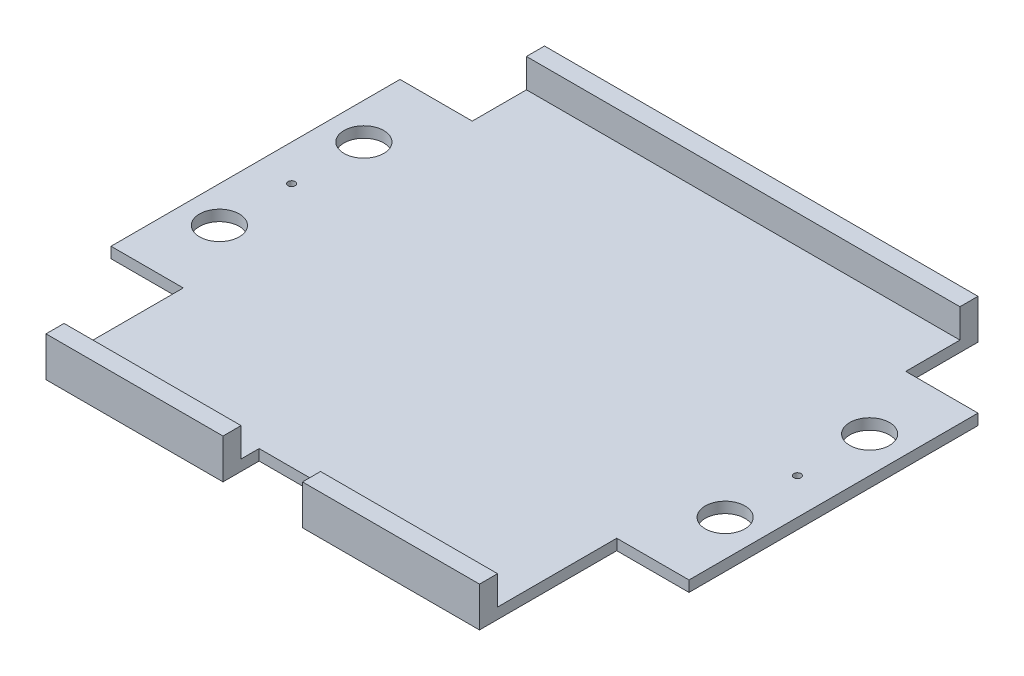
ISO-10303-21;
HEADER;
FILE_DESCRIPTION(('STEP AP214'),'2;1');
FILE_NAME('part.step','',(''),(''),'','','');
FILE_SCHEMA(('AUTOMOTIVE_DESIGN { 1 0 10303 214 1 1 1 1 }'));
ENDSEC;
DATA;
#1=APPLICATION_CONTEXT('core data for automotive mechanical design processes');
#2=APPLICATION_PROTOCOL_DEFINITION('international standard','automotive_design',2000,#1);
#3=PRODUCT_CONTEXT('',#1,'mechanical');
#4=PRODUCT('Part','Part','',(#3));
#5=PRODUCT_RELATED_PRODUCT_CATEGORY('part','',(#4));
#6=PRODUCT_DEFINITION_FORMATION('','',#4);
#7=PRODUCT_DEFINITION_CONTEXT('part definition',#1,'design');
#8=PRODUCT_DEFINITION('design','',#6,#7);
#9=PRODUCT_DEFINITION_SHAPE('','',#8);
#10=(LENGTH_UNIT() NAMED_UNIT(*) SI_UNIT(.MILLI.,.METRE.));
#11=(NAMED_UNIT(*) PLANE_ANGLE_UNIT() SI_UNIT($,.RADIAN.));
#12=(NAMED_UNIT(*) SI_UNIT($,.STERADIAN.) SOLID_ANGLE_UNIT());
#13=UNCERTAINTY_MEASURE_WITH_UNIT(LENGTH_MEASURE(1.E-05),#10,'distance_accuracy_value','');
#14=(GEOMETRIC_REPRESENTATION_CONTEXT(3) GLOBAL_UNCERTAINTY_ASSIGNED_CONTEXT((#13)) GLOBAL_UNIT_ASSIGNED_CONTEXT((#10,
#11,#12)) REPRESENTATION_CONTEXT('',''));
#15=CARTESIAN_POINT('',(0.,0.,0.));
#16=DIRECTION('',(0.,0.,1.));
#17=DIRECTION('',(1.,0.,0.));
#18=AXIS2_PLACEMENT_3D('',#15,#16,#17);
#19=CARTESIAN_POINT('',(-60.,3.,66.5));
#20=DIRECTION('',(1.,0.,0.));
#21=DIRECTION('',(0.,0.,-1.));
#22=AXIS2_PLACEMENT_3D('',#19,#20,#21);
#23=PLANE('',#22);
#24=DIRECTION('',(0.,0.,1.));
#25=VECTOR('',#24,1.);
#26=CARTESIAN_POINT('',(-60.,3.,66.5));
#27=LINE('',#26,#25);
#28=CARTESIAN_POINT('',(-60.,3.,28.5));
#29=VERTEX_POINT('',#28);
#30=CARTESIAN_POINT('',(-60.,3.,61.5));
#31=VERTEX_POINT('',#30);
#32=EDGE_CURVE('E57',#29,#31,#27,.T.);
#33=ORIENTED_EDGE('',*,*,#32,.F.);
#34=DIRECTION('',(0.,-1.,0.));
#35=VECTOR('',#34,1.);
#36=CARTESIAN_POINT('',(-60.,3.,28.5));
#37=LINE('',#36,#35);
#38=CARTESIAN_POINT('',(-60.,0.,28.5));
#39=VERTEX_POINT('',#38);
#40=EDGE_CURVE('E199',#29,#39,#37,.T.);
#41=ORIENTED_EDGE('',*,*,#40,.T.);
#42=DIRECTION('',(0.,0.,1.));
#43=VECTOR('',#42,1.);
#44=CARTESIAN_POINT('',(-60.,0.,66.5));
#45=LINE('',#44,#43);
#46=CARTESIAN_POINT('',(-60.,0.,66.5));
#47=VERTEX_POINT('',#46);
#48=EDGE_CURVE('E413',#39,#47,#45,.T.);
#49=ORIENTED_EDGE('',*,*,#48,.T.);
#50=DIRECTION('',(0.,-1.,0.));
#51=VECTOR('',#50,1.);
#52=CARTESIAN_POINT('',(-60.,3.,66.5));
#53=LINE('',#52,#51);
#54=CARTESIAN_POINT('',(-60.,11.,66.5));
#55=VERTEX_POINT('',#54);
#56=EDGE_CURVE('E425',#55,#47,#53,.T.);
#57=ORIENTED_EDGE('',*,*,#56,.F.);
#58=DIRECTION('',(0.,0.,1.));
#59=VECTOR('',#58,1.);
#60=CARTESIAN_POINT('',(-60.,11.,66.5));
#61=LINE('',#60,#59);
#62=CARTESIAN_POINT('',(-60.,11.,61.5));
#63=VERTEX_POINT('',#62);
#64=EDGE_CURVE('E367',#63,#55,#61,.T.);
#65=ORIENTED_EDGE('',*,*,#64,.F.);
#66=DIRECTION('',(0.,-1.,0.));
#67=VECTOR('',#66,1.);
#68=CARTESIAN_POINT('',(-60.,11.,61.5));
#69=LINE('',#68,#67);
#70=EDGE_CURVE('E385',#63,#31,#69,.T.);
#71=ORIENTED_EDGE('',*,*,#70,.T.);
#72=EDGE_LOOP('',(#33,#41,#49,#57,#65,#71));
#73=FACE_BOUND('',#72,.T.);
#74=ADVANCED_FACE('F39',(#73),#23,.F.);
#75=CARTESIAN_POINT('',(60.,3.,66.5));
#76=DIRECTION('',(-1.,0.,0.));
#77=DIRECTION('',(0.,0.,1.));
#78=AXIS2_PLACEMENT_3D('',#75,#76,#77);
#79=PLANE('',#78);
#80=DIRECTION('',(0.,-1.,0.));
#81=VECTOR('',#80,1.);
#82=CARTESIAN_POINT('',(60.,3.,28.5));
#83=LINE('',#82,#81);
#84=CARTESIAN_POINT('',(60.,3.,28.5));
#85=VERTEX_POINT('',#84);
#86=CARTESIAN_POINT('',(60.,0.,28.5));
#87=VERTEX_POINT('',#86);
#88=EDGE_CURVE('E284',#85,#87,#83,.T.);
#89=ORIENTED_EDGE('',*,*,#88,.F.);
#90=DIRECTION('',(0.,0.,-1.));
#91=VECTOR('',#90,1.);
#92=CARTESIAN_POINT('',(60.,3.,66.5));
#93=LINE('',#92,#91);
#94=CARTESIAN_POINT('',(60.,3.,61.5));
#95=VERTEX_POINT('',#94);
#96=EDGE_CURVE('E396',#95,#85,#93,.T.);
#97=ORIENTED_EDGE('',*,*,#96,.F.);
#98=DIRECTION('',(0.,-1.,0.));
#99=VECTOR('',#98,1.);
#100=CARTESIAN_POINT('',(60.,11.,61.5));
#101=LINE('',#100,#99);
#102=CARTESIAN_POINT('',(60.,11.,61.5));
#103=VERTEX_POINT('',#102);
#104=EDGE_CURVE('E391',#103,#95,#101,.T.);
#105=ORIENTED_EDGE('',*,*,#104,.F.);
#106=DIRECTION('',(0.,0.,-1.));
#107=VECTOR('',#106,1.);
#108=CARTESIAN_POINT('',(60.,11.,66.5));
#109=LINE('',#108,#107);
#110=CARTESIAN_POINT('',(60.,11.,66.5));
#111=VERTEX_POINT('',#110);
#112=EDGE_CURVE('E377',#111,#103,#109,.T.);
#113=ORIENTED_EDGE('',*,*,#112,.F.);
#114=DIRECTION('',(0.,-1.,0.));
#115=VECTOR('',#114,1.);
#116=CARTESIAN_POINT('',(60.,3.,66.5));
#117=LINE('',#116,#115);
#118=CARTESIAN_POINT('',(60.,0.,66.5));
#119=VERTEX_POINT('',#118);
#120=EDGE_CURVE('E408',#111,#119,#117,.T.);
#121=ORIENTED_EDGE('',*,*,#120,.T.);
#122=DIRECTION('',(0.,0.,-1.));
#123=VECTOR('',#122,1.);
#124=CARTESIAN_POINT('',(60.,0.,66.5));
#125=LINE('',#124,#123);
#126=EDGE_CURVE('E409',#119,#87,#125,.T.);
#127=ORIENTED_EDGE('',*,*,#126,.T.);
#128=EDGE_LOOP('',(#89,#97,#105,#113,#121,#127));
#129=FACE_BOUND('',#128,.T.);
#130=ADVANCED_FACE('F41',(#129),#79,.F.);
#131=DIRECTION('',(0.,1.,0.));
#132=VECTOR('',#131,1.);
#133=CARTESIAN_POINT('',(60.,3.,-51.5));
#134=LINE('',#133,#132);
#135=CARTESIAN_POINT('',(60.,0.,-51.5));
#136=VERTEX_POINT('',#135);
#137=CARTESIAN_POINT('',(60.,3.,-51.5));
#138=VERTEX_POINT('',#137);
#139=EDGE_CURVE('E280',#136,#138,#134,.T.);
#140=ORIENTED_EDGE('',*,*,#139,.F.);
#141=CARTESIAN_POINT('',(60.,0.,-71.5));
#142=VERTEX_POINT('',#141);
#143=EDGE_CURVE('E395',#136,#142,#125,.T.);
#144=ORIENTED_EDGE('',*,*,#143,.T.);
#145=DIRECTION('',(0.,-1.,0.));
#146=VECTOR('',#145,1.);
#147=CARTESIAN_POINT('',(60.,11.,-71.5));
#148=LINE('',#147,#146);
#149=CARTESIAN_POINT('',(60.,11.,-71.5));
#150=VERTEX_POINT('',#149);
#151=EDGE_CURVE('E308',#150,#142,#148,.T.);
#152=ORIENTED_EDGE('',*,*,#151,.F.);
#153=DIRECTION('',(0.,0.,-1.));
#154=VECTOR('',#153,1.);
#155=CARTESIAN_POINT('',(60.,11.,-66.5));
#156=LINE('',#155,#154);
#157=CARTESIAN_POINT('',(60.,11.,-66.5));
#158=VERTEX_POINT('',#157);
#159=EDGE_CURVE('E295',#158,#150,#156,.T.);
#160=ORIENTED_EDGE('',*,*,#159,.F.);
#161=DIRECTION('',(0.,-1.,0.));
#162=VECTOR('',#161,1.);
#163=CARTESIAN_POINT('',(60.,11.,-66.5));
#164=LINE('',#163,#162);
#165=CARTESIAN_POINT('',(60.,3.,-66.5));
#166=VERTEX_POINT('',#165);
#167=EDGE_CURVE('E312',#158,#166,#164,.T.);
#168=ORIENTED_EDGE('',*,*,#167,.T.);
#169=EDGE_CURVE('E401',#138,#166,#93,.T.);
#170=ORIENTED_EDGE('',*,*,#169,.F.);
#171=EDGE_LOOP('',(#140,#144,#152,#160,#168,#170));
#172=FACE_BOUND('',#171,.T.);
#173=ADVANCED_FACE('F497',(#172),#79,.F.);
#174=CARTESIAN_POINT('',(-60.,3.,66.5));
#175=DIRECTION('',(0.,0.,-1.));
#176=DIRECTION('',(-1.,0.,0.));
#177=AXIS2_PLACEMENT_3D('',#174,#175,#176);
#178=PLANE('',#177);
#179=DIRECTION('',(1.,0.,0.));
#180=VECTOR('',#179,1.);
#181=CARTESIAN_POINT('',(-60.,0.,66.5));
#182=LINE('',#181,#180);
#183=CARTESIAN_POINT('',(-11.,0.,66.5));
#184=VERTEX_POINT('',#183);
#185=EDGE_CURVE('E418',#47,#184,#182,.T.);
#186=ORIENTED_EDGE('',*,*,#185,.T.);
#187=DIRECTION('',(0.,1.,0.));
#188=VECTOR('',#187,1.);
#189=CARTESIAN_POINT('',(-11.,0.,66.5));
#190=LINE('',#189,#188);
#191=CARTESIAN_POINT('',(-11.,11.,66.5));
#192=VERTEX_POINT('',#191);
#193=EDGE_CURVE('E331',#184,#192,#190,.T.);
#194=ORIENTED_EDGE('',*,*,#193,.T.);
#195=DIRECTION('',(1.,0.,0.));
#196=VECTOR('',#195,1.);
#197=CARTESIAN_POINT('',(-60.,11.,66.5));
#198=LINE('',#197,#196);
#199=EDGE_CURVE('E373',#55,#192,#198,.T.);
#200=ORIENTED_EDGE('',*,*,#199,.F.);
#201=ORIENTED_EDGE('',*,*,#56,.T.);
#202=EDGE_LOOP('',(#186,#194,#200,#201));
#203=FACE_BOUND('',#202,.T.);
#204=ADVANCED_FACE('F507',(#203),#178,.F.);
#205=CARTESIAN_POINT('',(-60.,11.,61.5));
#206=DIRECTION('',(0.,0.,1.));
#207=DIRECTION('',(1.,0.,0.));
#208=AXIS2_PLACEMENT_3D('',#205,#206,#207);
#209=PLANE('',#208);
#210=DIRECTION('',(-1.,0.,0.));
#211=VECTOR('',#210,1.);
#212=CARTESIAN_POINT('',(-60.,11.,61.5));
#213=LINE('',#212,#211);
#214=CARTESIAN_POINT('',(-11.,11.,61.5));
#215=VERTEX_POINT('',#214);
#216=EDGE_CURVE('E380',#215,#63,#213,.T.);
#217=ORIENTED_EDGE('',*,*,#216,.F.);
#218=DIRECTION('',(0.,-1.,0.));
#219=VECTOR('',#218,1.);
#220=CARTESIAN_POINT('',(-11.,11.,61.5));
#221=LINE('',#220,#219);
#222=CARTESIAN_POINT('',(-11.,3.,61.5));
#223=VERTEX_POINT('',#222);
#224=EDGE_CURVE('E354',#215,#223,#221,.T.);
#225=ORIENTED_EDGE('',*,*,#224,.T.);
#226=DIRECTION('',(-1.,0.,0.));
#227=VECTOR('',#226,1.);
#228=CARTESIAN_POINT('',(-60.,3.,61.5));
#229=LINE('',#228,#227);
#230=EDGE_CURVE('E366',#223,#31,#229,.T.);
#231=ORIENTED_EDGE('',*,*,#230,.T.);
#232=ORIENTED_EDGE('',*,*,#70,.F.);
#233=EDGE_LOOP('',(#217,#225,#231,#232));
#234=FACE_BOUND('',#233,.T.);
#235=ADVANCED_FACE('F529',(#234),#209,.F.);
#236=CARTESIAN_POINT('',(0.,11.,0.));
#237=DIRECTION('',(0.,-1.,0.));
#238=DIRECTION('',(0.,0.,-1.));
#239=AXIS2_PLACEMENT_3D('',#236,#237,#238);
#240=PLANE('',#239);
#241=ORIENTED_EDGE('',*,*,#199,.T.);
#242=DIRECTION('',(0.,0.,-1.));
#243=VECTOR('',#242,1.);
#244=CARTESIAN_POINT('',(-11.,11.,0.));
#245=LINE('',#244,#243);
#246=EDGE_CURVE('E11',#192,#215,#245,.T.);
#247=ORIENTED_EDGE('',*,*,#246,.T.);
#248=ORIENTED_EDGE('',*,*,#216,.T.);
#249=ORIENTED_EDGE('',*,*,#64,.T.);
#250=EDGE_LOOP('',(#241,#247,#248,#249));
#251=FACE_BOUND('',#250,.T.);
#252=ADVANCED_FACE('F509',(#251),#240,.F.);
#253=CARTESIAN_POINT('',(0.,3.,0.));
#254=DIRECTION('',(0.,-1.,0.));
#255=DIRECTION('',(0.,0.,-1.));
#256=AXIS2_PLACEMENT_3D('',#253,#254,#255);
#257=PLANE('',#256);
#258=CARTESIAN_POINT('',(-70.,3.,-31.5));
#259=DIRECTION('',(0.,-1.,0.));
#260=DIRECTION('',(0.,0.,1.));
#261=AXIS2_PLACEMENT_3D('',#258,#259,#260);
#262=CIRCLE('',#261,5.5);
#263=CARTESIAN_POINT('',(-70.,3.,-26.));
#264=VERTEX_POINT('',#263);
#265=EDGE_CURVE('E464',#264,#264,#262,.T.);
#266=ORIENTED_EDGE('',*,*,#265,.T.);
#267=EDGE_LOOP('',(#266));
#268=FACE_BOUND('',#267,.T.);
#269=CARTESIAN_POINT('',(-70.,3.,8.5));
#270=DIRECTION('',(0.,-1.,0.));
#271=DIRECTION('',(0.,0.,1.));
#272=AXIS2_PLACEMENT_3D('',#269,#270,#271);
#273=CIRCLE('',#272,5.5);
#274=CARTESIAN_POINT('',(-70.,3.,14.));
#275=VERTEX_POINT('',#274);
#276=EDGE_CURVE('E467',#275,#275,#273,.T.);
#277=ORIENTED_EDGE('',*,*,#276,.T.);
#278=EDGE_LOOP('',(#277));
#279=FACE_BOUND('',#278,.T.);
#280=CARTESIAN_POINT('',(-70.,3.,-11.5));
#281=DIRECTION('',(0.,-1.,0.));
#282=DIRECTION('',(0.,0.,1.));
#283=AXIS2_PLACEMENT_3D('',#280,#281,#282);
#284=CIRCLE('',#283,0.999999999999998);
#285=CARTESIAN_POINT('',(-70.,3.,-10.5));
#286=VERTEX_POINT('',#285);
#287=EDGE_CURVE('E446',#286,#286,#284,.T.);
#288=ORIENTED_EDGE('',*,*,#287,.T.);
#289=EDGE_LOOP('',(#288));
#290=FACE_BOUND('',#289,.T.);
#291=DIRECTION('',(1.,0.,0.));
#292=VECTOR('',#291,1.);
#293=CARTESIAN_POINT('',(-80.,3.,28.5));
#294=LINE('',#293,#292);
#295=CARTESIAN_POINT('',(-80.,3.,28.5));
#296=VERTEX_POINT('',#295);
#297=EDGE_CURVE('E193',#296,#29,#294,.T.);
#298=ORIENTED_EDGE('',*,*,#297,.T.);
#299=ORIENTED_EDGE('',*,*,#32,.T.);
#300=ORIENTED_EDGE('',*,*,#230,.F.);
#301=DIRECTION('',(0.,0.,-1.));
#302=VECTOR('',#301,1.);
#303=CARTESIAN_POINT('',(-11.,3.,0.));
#304=LINE('',#303,#302);
#305=CARTESIAN_POINT('',(-11.,3.,56.5));
#306=VERTEX_POINT('',#305);
#307=EDGE_CURVE('E358',#223,#306,#304,.T.);
#308=ORIENTED_EDGE('',*,*,#307,.T.);
#309=DIRECTION('',(1.,0.,0.));
#310=VECTOR('',#309,1.);
#311=CARTESIAN_POINT('',(0.,3.,56.5));
#312=LINE('',#311,#310);
#313=CARTESIAN_POINT('',(11.,3.,56.5));
#314=VERTEX_POINT('',#313);
#315=EDGE_CURVE('E362',#306,#314,#312,.T.);
#316=ORIENTED_EDGE('',*,*,#315,.T.);
#317=DIRECTION('',(0.,0.,1.));
#318=VECTOR('',#317,1.);
#319=CARTESIAN_POINT('',(11.,3.,0.));
#320=LINE('',#319,#318);
#321=CARTESIAN_POINT('',(11.,3.,61.5));
#322=VERTEX_POINT('',#321);
#323=EDGE_CURVE('E350',#314,#322,#320,.T.);
#324=ORIENTED_EDGE('',*,*,#323,.T.);
#325=EDGE_CURVE('E372',#95,#322,#229,.T.);
#326=ORIENTED_EDGE('',*,*,#325,.F.);
#327=ORIENTED_EDGE('',*,*,#96,.T.);
#328=DIRECTION('',(-1.,0.,0.));
#329=VECTOR('',#328,1.);
#330=CARTESIAN_POINT('',(80.,3.,28.5));
#331=LINE('',#330,#329);
#332=CARTESIAN_POINT('',(80.,3.,28.5));
#333=VERTEX_POINT('',#332);
#334=EDGE_CURVE('E267',#333,#85,#331,.T.);
#335=ORIENTED_EDGE('',*,*,#334,.F.);
#336=DIRECTION('',(0.,0.,1.));
#337=VECTOR('',#336,1.);
#338=CARTESIAN_POINT('',(80.,3.,28.5));
#339=LINE('',#338,#337);
#340=CARTESIAN_POINT('',(80.,3.,-51.5));
#341=VERTEX_POINT('',#340);
#342=EDGE_CURVE('E264',#341,#333,#339,.T.);
#343=ORIENTED_EDGE('',*,*,#342,.F.);
#344=DIRECTION('',(-1.,0.,0.));
#345=VECTOR('',#344,1.);
#346=CARTESIAN_POINT('',(80.,3.,-51.5));
#347=LINE('',#346,#345);
#348=EDGE_CURVE('E270',#341,#138,#347,.T.);
#349=ORIENTED_EDGE('',*,*,#348,.T.);
#350=ORIENTED_EDGE('',*,*,#169,.T.);
#351=DIRECTION('',(-1.,0.,0.));
#352=VECTOR('',#351,1.);
#353=CARTESIAN_POINT('',(-60.,3.,-66.5));
#354=LINE('',#353,#352);
#355=CARTESIAN_POINT('',(-60.,3.,-66.5));
#356=VERTEX_POINT('',#355);
#357=EDGE_CURVE('E400',#166,#356,#354,.T.);
#358=ORIENTED_EDGE('',*,*,#357,.T.);
#359=CARTESIAN_POINT('',(-60.,3.,-51.5));
#360=VERTEX_POINT('',#359);
#361=EDGE_CURVE('E405',#356,#360,#27,.T.);
#362=ORIENTED_EDGE('',*,*,#361,.T.);
#363=DIRECTION('',(1.,0.,0.));
#364=VECTOR('',#363,1.);
#365=CARTESIAN_POINT('',(-80.,3.,-51.5));
#366=LINE('',#365,#364);
#367=CARTESIAN_POINT('',(-80.,3.,-51.5));
#368=VERTEX_POINT('',#367);
#369=EDGE_CURVE('E203',#368,#360,#366,.T.);
#370=ORIENTED_EDGE('',*,*,#369,.F.);
#371=DIRECTION('',(0.,0.,1.));
#372=VECTOR('',#371,1.);
#373=CARTESIAN_POINT('',(-80.,3.,28.5));
#374=LINE('',#373,#372);
#375=EDGE_CURVE('E209',#368,#296,#374,.T.);
#376=ORIENTED_EDGE('',*,*,#375,.T.);
#377=EDGE_LOOP('',(#298,#299,#300,#308,#316,#324,#326,#327,#335,#343,#349,#350,#358,#362,#370,#376));
#378=FACE_BOUND('',#377,.T.);
#379=CARTESIAN_POINT('',(70.,3.,-31.5));
#380=DIRECTION('',(0.,1.,0.));
#381=DIRECTION('',(0.,0.,1.));
#382=AXIS2_PLACEMENT_3D('',#379,#380,#381);
#383=CIRCLE('',#382,5.5);
#384=CARTESIAN_POINT('',(70.,3.,-26.));
#385=VERTEX_POINT('',#384);
#386=EDGE_CURVE('E240',#385,#385,#383,.T.);
#387=ORIENTED_EDGE('',*,*,#386,.F.);
#388=EDGE_LOOP('',(#387));
#389=FACE_BOUND('',#388,.T.);
#390=CARTESIAN_POINT('',(70.,3.,8.5));
#391=DIRECTION('',(0.,1.,0.));
#392=DIRECTION('',(0.,0.,1.));
#393=AXIS2_PLACEMENT_3D('',#390,#391,#392);
#394=CIRCLE('',#393,5.5);
#395=CARTESIAN_POINT('',(70.,3.,14.));
#396=VERTEX_POINT('',#395);
#397=EDGE_CURVE('E241',#396,#396,#394,.T.);
#398=ORIENTED_EDGE('',*,*,#397,.F.);
#399=EDGE_LOOP('',(#398));
#400=FACE_BOUND('',#399,.T.);
#401=CARTESIAN_POINT('',(70.,3.,-11.5));
#402=DIRECTION('',(0.,1.,0.));
#403=DIRECTION('',(0.,0.,1.));
#404=AXIS2_PLACEMENT_3D('',#401,#402,#403);
#405=CIRCLE('',#404,0.999999999999998);
#406=CARTESIAN_POINT('',(70.,3.,-10.5));
#407=VERTEX_POINT('',#406);
#408=EDGE_CURVE('E245',#407,#407,#405,.T.);
#409=ORIENTED_EDGE('',*,*,#408,.F.);
#410=EDGE_LOOP('',(#409));
#411=FACE_BOUND('',#410,.T.);
#412=ADVANCED_FACE('F215',(#268,#279,#290,#378,#389,#400,#411),#257,.F.);
#413=CARTESIAN_POINT('',(-60.,0.,-71.5));
#414=VERTEX_POINT('',#413);
#415=CARTESIAN_POINT('',(-60.,0.,-51.5));
#416=VERTEX_POINT('',#415);
#417=EDGE_CURVE('E414',#414,#416,#45,.T.);
#418=ORIENTED_EDGE('',*,*,#417,.T.);
#419=DIRECTION('',(0.,1.,0.));
#420=VECTOR('',#419,1.);
#421=CARTESIAN_POINT('',(-60.,3.,-51.5));
#422=LINE('',#421,#420);
#423=EDGE_CURVE('E65',#416,#360,#422,.T.);
#424=ORIENTED_EDGE('',*,*,#423,.T.);
#425=ORIENTED_EDGE('',*,*,#361,.F.);
#426=DIRECTION('',(0.,-1.,0.));
#427=VECTOR('',#426,1.);
#428=CARTESIAN_POINT('',(-60.,11.,-66.5));
#429=LINE('',#428,#427);
#430=CARTESIAN_POINT('',(-60.,11.,-66.5));
#431=VERTEX_POINT('',#430);
#432=EDGE_CURVE('E316',#431,#356,#429,.T.);
#433=ORIENTED_EDGE('',*,*,#432,.F.);
#434=DIRECTION('',(0.,0.,1.));
#435=VECTOR('',#434,1.);
#436=CARTESIAN_POINT('',(-60.,11.,-66.5));
#437=LINE('',#436,#435);
#438=CARTESIAN_POINT('',(-60.,11.,-71.5));
#439=VERTEX_POINT('',#438);
#440=EDGE_CURVE('E288',#439,#431,#437,.T.);
#441=ORIENTED_EDGE('',*,*,#440,.F.);
#442=DIRECTION('',(0.,-1.,0.));
#443=VECTOR('',#442,1.);
#444=CARTESIAN_POINT('',(-60.,11.,-71.5));
#445=LINE('',#444,#443);
#446=EDGE_CURVE('E301',#439,#414,#445,.T.);
#447=ORIENTED_EDGE('',*,*,#446,.T.);
#448=EDGE_LOOP('',(#418,#424,#425,#433,#441,#447));
#449=FACE_BOUND('',#448,.T.);
#450=ADVANCED_FACE('F491',(#449),#23,.F.);
#451=CARTESIAN_POINT('',(11.,11.,66.5));
#452=VERTEX_POINT('',#451);
#453=EDGE_CURVE('E371',#452,#111,#198,.T.);
#454=ORIENTED_EDGE('',*,*,#453,.F.);
#455=DIRECTION('',(0.,1.,0.));
#456=VECTOR('',#455,1.);
#457=CARTESIAN_POINT('',(11.,0.,66.5));
#458=LINE('',#457,#456);
#459=CARTESIAN_POINT('',(11.,0.,66.5));
#460=VERTEX_POINT('',#459);
#461=EDGE_CURVE('E341',#460,#452,#458,.T.);
#462=ORIENTED_EDGE('',*,*,#461,.F.);
#463=EDGE_CURVE('E417',#460,#119,#182,.T.);
#464=ORIENTED_EDGE('',*,*,#463,.T.);
#465=ORIENTED_EDGE('',*,*,#120,.F.);
#466=EDGE_LOOP('',(#454,#462,#464,#465));
#467=FACE_BOUND('',#466,.T.);
#468=ADVANCED_FACE('F501',(#467),#178,.F.);
#469=CARTESIAN_POINT('',(0.,0.,0.));
#470=DIRECTION('',(0.,-1.,0.));
#471=DIRECTION('',(0.,0.,-1.));
#472=AXIS2_PLACEMENT_3D('',#469,#470,#471);
#473=PLANE('',#472);
#474=CARTESIAN_POINT('',(-70.,0.,-31.5));
#475=DIRECTION('',(0.,-1.,0.));
#476=DIRECTION('',(0.,0.,-1.));
#477=AXIS2_PLACEMENT_3D('',#474,#475,#476);
#478=CIRCLE('',#477,5.5);
#479=CARTESIAN_POINT('',(-70.,0.,-37.));
#480=VERTEX_POINT('',#479);
#481=EDGE_CURVE('E43',#480,#480,#478,.F.);
#482=ORIENTED_EDGE('',*,*,#481,.T.);
#483=EDGE_LOOP('',(#482));
#484=FACE_BOUND('',#483,.T.);
#485=CARTESIAN_POINT('',(-70.,0.,8.5));
#486=DIRECTION('',(0.,-1.,0.));
#487=DIRECTION('',(0.,0.,-1.));
#488=AXIS2_PLACEMENT_3D('',#485,#486,#487);
#489=CIRCLE('',#488,5.5);
#490=CARTESIAN_POINT('',(-70.,0.,2.99999999999999));
#491=VERTEX_POINT('',#490);
#492=EDGE_CURVE('E445',#491,#491,#489,.F.);
#493=ORIENTED_EDGE('',*,*,#492,.T.);
#494=EDGE_LOOP('',(#493));
#495=FACE_BOUND('',#494,.T.);
#496=CARTESIAN_POINT('',(-70.,0.,-11.5));
#497=DIRECTION('',(0.,-1.,0.));
#498=DIRECTION('',(0.,0.,-1.));
#499=AXIS2_PLACEMENT_3D('',#496,#497,#498);
#500=CIRCLE('',#499,0.999999999999998);
#501=CARTESIAN_POINT('',(-70.,0.,-12.5));
#502=VERTEX_POINT('',#501);
#503=EDGE_CURVE('E442',#502,#502,#500,.F.);
#504=ORIENTED_EDGE('',*,*,#503,.T.);
#505=EDGE_LOOP('',(#504));
#506=FACE_BOUND('',#505,.T.);
#507=ORIENTED_EDGE('',*,*,#48,.F.);
#508=DIRECTION('',(1.,0.,0.));
#509=VECTOR('',#508,1.);
#510=CARTESIAN_POINT('',(-80.,0.,28.5));
#511=LINE('',#510,#509);
#512=CARTESIAN_POINT('',(-80.,0.,28.5));
#513=VERTEX_POINT('',#512);
#514=EDGE_CURVE('E227',#513,#39,#511,.T.);
#515=ORIENTED_EDGE('',*,*,#514,.F.);
#516=DIRECTION('',(0.,0.,-1.));
#517=VECTOR('',#516,1.);
#518=CARTESIAN_POINT('',(-80.,0.,28.5));
#519=LINE('',#518,#517);
#520=CARTESIAN_POINT('',(-80.,0.,-51.5));
#521=VERTEX_POINT('',#520);
#522=EDGE_CURVE('E212',#513,#521,#519,.T.);
#523=ORIENTED_EDGE('',*,*,#522,.T.);
#524=DIRECTION('',(1.,0.,0.));
#525=VECTOR('',#524,1.);
#526=CARTESIAN_POINT('',(-80.,0.,-51.5));
#527=LINE('',#526,#525);
#528=EDGE_CURVE('E230',#521,#416,#527,.T.);
#529=ORIENTED_EDGE('',*,*,#528,.T.);
#530=ORIENTED_EDGE('',*,*,#417,.F.);
#531=DIRECTION('',(-1.,0.,0.));
#532=VECTOR('',#531,1.);
#533=CARTESIAN_POINT('',(-60.,0.,-71.5));
#534=LINE('',#533,#532);
#535=EDGE_CURVE('E287',#142,#414,#534,.T.);
#536=ORIENTED_EDGE('',*,*,#535,.F.);
#537=ORIENTED_EDGE('',*,*,#143,.F.);
#538=DIRECTION('',(-1.,0.,0.));
#539=VECTOR('',#538,1.);
#540=CARTESIAN_POINT('',(80.,0.,-51.5));
#541=LINE('',#540,#539);
#542=CARTESIAN_POINT('',(80.,0.,-51.5));
#543=VERTEX_POINT('',#542);
#544=EDGE_CURVE('E273',#543,#136,#541,.T.);
#545=ORIENTED_EDGE('',*,*,#544,.F.);
#546=DIRECTION('',(0.,0.,-1.));
#547=VECTOR('',#546,1.);
#548=CARTESIAN_POINT('',(80.,0.,28.5));
#549=LINE('',#548,#547);
#550=CARTESIAN_POINT('',(80.,0.,28.5));
#551=VERTEX_POINT('',#550);
#552=EDGE_CURVE('E257',#551,#543,#549,.T.);
#553=ORIENTED_EDGE('',*,*,#552,.F.);
#554=DIRECTION('',(-1.,0.,0.));
#555=VECTOR('',#554,1.);
#556=CARTESIAN_POINT('',(80.,0.,28.5));
#557=LINE('',#556,#555);
#558=EDGE_CURVE('E276',#551,#87,#557,.T.);
#559=ORIENTED_EDGE('',*,*,#558,.T.);
#560=ORIENTED_EDGE('',*,*,#126,.F.);
#561=ORIENTED_EDGE('',*,*,#463,.F.);
#562=DIRECTION('',(0.,0.,-1.));
#563=VECTOR('',#562,1.);
#564=CARTESIAN_POINT('',(11.,0.,66.5));
#565=LINE('',#564,#563);
#566=CARTESIAN_POINT('',(11.,0.,56.5));
#567=VERTEX_POINT('',#566);
#568=EDGE_CURVE('E323',#460,#567,#565,.T.);
#569=ORIENTED_EDGE('',*,*,#568,.T.);
#570=DIRECTION('',(-1.,0.,0.));
#571=VECTOR('',#570,1.);
#572=CARTESIAN_POINT('',(-11.,0.,56.5));
#573=LINE('',#572,#571);
#574=CARTESIAN_POINT('',(-11.,0.,56.5));
#575=VERTEX_POINT('',#574);
#576=EDGE_CURVE('E327',#567,#575,#573,.T.);
#577=ORIENTED_EDGE('',*,*,#576,.T.);
#578=DIRECTION('',(0.,0.,1.));
#579=VECTOR('',#578,1.);
#580=CARTESIAN_POINT('',(-11.,0.,66.5));
#581=LINE('',#580,#579);
#582=EDGE_CURVE('E319',#575,#184,#581,.T.);
#583=ORIENTED_EDGE('',*,*,#582,.T.);
#584=ORIENTED_EDGE('',*,*,#185,.F.);
#585=EDGE_LOOP('',(#507,#515,#523,#529,#530,#536,#537,#545,#553,#559,#560,#561,#569,#577,#583,#584));
#586=FACE_BOUND('',#585,.T.);
#587=CARTESIAN_POINT('',(70.,0.,-31.5));
#588=DIRECTION('',(0.,-1.,0.));
#589=DIRECTION('',(0.,0.,-1.));
#590=AXIS2_PLACEMENT_3D('',#587,#588,#589);
#591=CIRCLE('',#590,5.5);
#592=CARTESIAN_POINT('',(70.,0.,-37.));
#593=VERTEX_POINT('',#592);
#594=EDGE_CURVE('E258',#593,#593,#591,.T.);
#595=ORIENTED_EDGE('',*,*,#594,.F.);
#596=EDGE_LOOP('',(#595));
#597=FACE_BOUND('',#596,.T.);
#598=CARTESIAN_POINT('',(70.,0.,8.5));
#599=DIRECTION('',(0.,-1.,0.));
#600=DIRECTION('',(0.,0.,-1.));
#601=AXIS2_PLACEMENT_3D('',#598,#599,#600);
#602=CIRCLE('',#601,5.5);
#603=CARTESIAN_POINT('',(70.,0.,2.99999999999999));
#604=VERTEX_POINT('',#603);
#605=EDGE_CURVE('E435',#604,#604,#602,.T.);
#606=ORIENTED_EDGE('',*,*,#605,.F.);
#607=EDGE_LOOP('',(#606));
#608=FACE_BOUND('',#607,.T.);
#609=CARTESIAN_POINT('',(70.,0.,-11.5));
#610=DIRECTION('',(0.,-1.,0.));
#611=DIRECTION('',(0.,0.,-1.));
#612=AXIS2_PLACEMENT_3D('',#609,#610,#611);
#613=CIRCLE('',#612,0.999999999999998);
#614=CARTESIAN_POINT('',(70.,0.,-12.5));
#615=VERTEX_POINT('',#614);
#616=EDGE_CURVE('E252',#615,#615,#613,.T.);
#617=ORIENTED_EDGE('',*,*,#616,.F.);
#618=EDGE_LOOP('',(#617));
#619=FACE_BOUND('',#618,.T.);
#620=ADVANCED_FACE('F455',(#484,#495,#506,#586,#597,#608,#619),#473,.T.);
#621=ORIENTED_EDGE('',*,*,#325,.T.);
#622=DIRECTION('',(0.,1.,0.));
#623=VECTOR('',#622,1.);
#624=CARTESIAN_POINT('',(11.,11.,61.5));
#625=LINE('',#624,#623);
#626=CARTESIAN_POINT('',(11.,11.,61.5));
#627=VERTEX_POINT('',#626);
#628=EDGE_CURVE('E336',#322,#627,#625,.T.);
#629=ORIENTED_EDGE('',*,*,#628,.T.);
#630=EDGE_CURVE('E381',#103,#627,#213,.T.);
#631=ORIENTED_EDGE('',*,*,#630,.F.);
#632=ORIENTED_EDGE('',*,*,#104,.T.);
#633=EDGE_LOOP('',(#621,#629,#631,#632));
#634=FACE_BOUND('',#633,.T.);
#635=ADVANCED_FACE('F542',(#634),#209,.F.);
#636=ORIENTED_EDGE('',*,*,#630,.T.);
#637=DIRECTION('',(0.,0.,1.));
#638=VECTOR('',#637,1.);
#639=CARTESIAN_POINT('',(11.,11.,0.));
#640=LINE('',#639,#638);
#641=EDGE_CURVE('E49',#627,#452,#640,.T.);
#642=ORIENTED_EDGE('',*,*,#641,.T.);
#643=ORIENTED_EDGE('',*,*,#453,.T.);
#644=ORIENTED_EDGE('',*,*,#112,.T.);
#645=EDGE_LOOP('',(#636,#642,#643,#644));
#646=FACE_BOUND('',#645,.T.);
#647=ADVANCED_FACE('F549',(#646),#240,.F.);
#648=CARTESIAN_POINT('',(-11.,0.,56.5));
#649=DIRECTION('',(0.,0.,-1.));
#650=DIRECTION('',(-1.,0.,0.));
#651=AXIS2_PLACEMENT_3D('',#648,#649,#650);
#652=PLANE('',#651);
#653=DIRECTION('',(0.,1.,0.));
#654=VECTOR('',#653,1.);
#655=CARTESIAN_POINT('',(-11.,0.,56.5));
#656=LINE('',#655,#654);
#657=EDGE_CURVE('E332',#575,#306,#656,.T.);
#658=ORIENTED_EDGE('',*,*,#657,.F.);
#659=ORIENTED_EDGE('',*,*,#576,.F.);
#660=DIRECTION('',(0.,1.,0.));
#661=VECTOR('',#660,1.);
#662=CARTESIAN_POINT('',(11.,0.,56.5));
#663=LINE('',#662,#661);
#664=EDGE_CURVE('E337',#567,#314,#663,.T.);
#665=ORIENTED_EDGE('',*,*,#664,.T.);
#666=ORIENTED_EDGE('',*,*,#315,.F.);
#667=EDGE_LOOP('',(#658,#659,#665,#666));
#668=FACE_BOUND('',#667,.T.);
#669=ADVANCED_FACE('F553',(#668),#652,.F.);
#670=CARTESIAN_POINT('',(-11.,0.,66.5));
#671=DIRECTION('',(-1.,0.,0.));
#672=DIRECTION('',(0.,0.,1.));
#673=AXIS2_PLACEMENT_3D('',#670,#671,#672);
#674=PLANE('',#673);
#675=ORIENTED_EDGE('',*,*,#224,.F.);
#676=ORIENTED_EDGE('',*,*,#246,.F.);
#677=ORIENTED_EDGE('',*,*,#193,.F.);
#678=ORIENTED_EDGE('',*,*,#582,.F.);
#679=ORIENTED_EDGE('',*,*,#657,.T.);
#680=ORIENTED_EDGE('',*,*,#307,.F.);
#681=EDGE_LOOP('',(#675,#676,#677,#678,#679,#680));
#682=FACE_BOUND('',#681,.T.);
#683=ADVANCED_FACE('F534',(#682),#674,.F.);
#684=CARTESIAN_POINT('',(11.,0.,66.5));
#685=DIRECTION('',(1.,0.,0.));
#686=DIRECTION('',(0.,0.,-1.));
#687=AXIS2_PLACEMENT_3D('',#684,#685,#686);
#688=PLANE('',#687);
#689=ORIENTED_EDGE('',*,*,#664,.F.);
#690=ORIENTED_EDGE('',*,*,#568,.F.);
#691=ORIENTED_EDGE('',*,*,#461,.T.);
#692=ORIENTED_EDGE('',*,*,#641,.F.);
#693=ORIENTED_EDGE('',*,*,#628,.F.);
#694=ORIENTED_EDGE('',*,*,#323,.F.);
#695=EDGE_LOOP('',(#689,#690,#691,#692,#693,#694));
#696=FACE_BOUND('',#695,.T.);
#697=ADVANCED_FACE('F557',(#696),#688,.F.);
#698=CARTESIAN_POINT('',(-60.,11.,-66.5));
#699=DIRECTION('',(0.,0.,-1.));
#700=DIRECTION('',(-1.,0.,0.));
#701=AXIS2_PLACEMENT_3D('',#698,#699,#700);
#702=PLANE('',#701);
#703=ORIENTED_EDGE('',*,*,#357,.F.);
#704=ORIENTED_EDGE('',*,*,#167,.F.);
#705=DIRECTION('',(1.,0.,0.));
#706=VECTOR('',#705,1.);
#707=CARTESIAN_POINT('',(-60.,11.,-66.5));
#708=LINE('',#707,#706);
#709=EDGE_CURVE('E292',#431,#158,#708,.T.);
#710=ORIENTED_EDGE('',*,*,#709,.F.);
#711=ORIENTED_EDGE('',*,*,#432,.T.);
#712=EDGE_LOOP('',(#703,#704,#710,#711));
#713=FACE_BOUND('',#712,.T.);
#714=ADVANCED_FACE('F560',(#713),#702,.F.);
#715=CARTESIAN_POINT('',(-60.,11.,-71.5));
#716=DIRECTION('',(0.,0.,1.));
#717=DIRECTION('',(1.,0.,0.));
#718=AXIS2_PLACEMENT_3D('',#715,#716,#717);
#719=PLANE('',#718);
#720=ORIENTED_EDGE('',*,*,#535,.T.);
#721=ORIENTED_EDGE('',*,*,#446,.F.);
#722=DIRECTION('',(-1.,0.,0.));
#723=VECTOR('',#722,1.);
#724=CARTESIAN_POINT('',(-60.,11.,-71.5));
#725=LINE('',#724,#723);
#726=EDGE_CURVE('E298',#150,#439,#725,.T.);
#727=ORIENTED_EDGE('',*,*,#726,.F.);
#728=ORIENTED_EDGE('',*,*,#151,.T.);
#729=EDGE_LOOP('',(#720,#721,#727,#728));
#730=FACE_BOUND('',#729,.T.);
#731=ADVANCED_FACE('F567',(#730),#719,.F.);
#732=CARTESIAN_POINT('',(0.,11.,0.));
#733=DIRECTION('',(0.,-1.,0.));
#734=DIRECTION('',(0.,0.,-1.));
#735=AXIS2_PLACEMENT_3D('',#732,#733,#734);
#736=PLANE('',#735);
#737=ORIENTED_EDGE('',*,*,#440,.T.);
#738=ORIENTED_EDGE('',*,*,#709,.T.);
#739=ORIENTED_EDGE('',*,*,#159,.T.);
#740=ORIENTED_EDGE('',*,*,#726,.T.);
#741=EDGE_LOOP('',(#737,#738,#739,#740));
#742=FACE_BOUND('',#741,.T.);
#743=ADVANCED_FACE('F571',(#742),#736,.F.);
#744=CARTESIAN_POINT('',(80.,3.,28.5));
#745=DIRECTION('',(0.,0.,-1.));
#746=DIRECTION('',(-1.,0.,0.));
#747=AXIS2_PLACEMENT_3D('',#744,#745,#746);
#748=PLANE('',#747);
#749=ORIENTED_EDGE('',*,*,#334,.T.);
#750=ORIENTED_EDGE('',*,*,#88,.T.);
#751=ORIENTED_EDGE('',*,*,#558,.F.);
#752=DIRECTION('',(0.,-1.,0.));
#753=VECTOR('',#752,1.);
#754=CARTESIAN_POINT('',(80.,3.,28.5));
#755=LINE('',#754,#753);
#756=EDGE_CURVE('E253',#333,#551,#755,.T.);
#757=ORIENTED_EDGE('',*,*,#756,.F.);
#758=EDGE_LOOP('',(#749,#750,#751,#757));
#759=FACE_BOUND('',#758,.T.);
#760=ADVANCED_FACE('F575',(#759),#748,.F.);
#761=CARTESIAN_POINT('',(80.,3.,-51.5));
#762=DIRECTION('',(0.,0.,1.));
#763=DIRECTION('',(1.,0.,0.));
#764=AXIS2_PLACEMENT_3D('',#761,#762,#763);
#765=PLANE('',#764);
#766=ORIENTED_EDGE('',*,*,#544,.T.);
#767=ORIENTED_EDGE('',*,*,#139,.T.);
#768=ORIENTED_EDGE('',*,*,#348,.F.);
#769=DIRECTION('',(0.,1.,0.));
#770=VECTOR('',#769,1.);
#771=CARTESIAN_POINT('',(80.,3.,-51.5));
#772=LINE('',#771,#770);
#773=EDGE_CURVE('E261',#543,#341,#772,.T.);
#774=ORIENTED_EDGE('',*,*,#773,.F.);
#775=EDGE_LOOP('',(#766,#767,#768,#774));
#776=FACE_BOUND('',#775,.T.);
#777=ADVANCED_FACE('F579',(#776),#765,.F.);
#778=CARTESIAN_POINT('',(80.,0.,0.));
#779=DIRECTION('',(1.,0.,0.));
#780=DIRECTION('',(0.,0.,-1.));
#781=AXIS2_PLACEMENT_3D('',#778,#779,#780);
#782=PLANE('',#781);
#783=ORIENTED_EDGE('',*,*,#756,.T.);
#784=ORIENTED_EDGE('',*,*,#552,.T.);
#785=ORIENTED_EDGE('',*,*,#773,.T.);
#786=ORIENTED_EDGE('',*,*,#342,.T.);
#787=EDGE_LOOP('',(#783,#784,#785,#786));
#788=FACE_BOUND('',#787,.T.);
#789=ADVANCED_FACE('F583',(#788),#782,.T.);
#790=CARTESIAN_POINT('',(70.,-77.,-11.5));
#791=DIRECTION('',(0.,1.,0.));
#792=DIRECTION('',(0.,0.,1.));
#793=AXIS2_PLACEMENT_3D('',#790,#791,#792);
#794=CYLINDRICAL_SURFACE('',#793,0.999999999999998);
#795=ORIENTED_EDGE('',*,*,#616,.T.);
#796=EDGE_LOOP('',(#795));
#797=FACE_BOUND('',#796,.T.);
#798=ORIENTED_EDGE('',*,*,#408,.T.);
#799=EDGE_LOOP('',(#798));
#800=FACE_BOUND('',#799,.T.);
#801=ADVANCED_FACE('F587',(#797,#800),#794,.F.);
#802=CARTESIAN_POINT('',(70.,-77.,8.5));
#803=DIRECTION('',(0.,1.,0.));
#804=DIRECTION('',(0.,0.,1.));
#805=AXIS2_PLACEMENT_3D('',#802,#803,#804);
#806=CYLINDRICAL_SURFACE('',#805,5.5);
#807=ORIENTED_EDGE('',*,*,#605,.T.);
#808=EDGE_LOOP('',(#807));
#809=FACE_BOUND('',#808,.T.);
#810=ORIENTED_EDGE('',*,*,#397,.T.);
#811=EDGE_LOOP('',(#810));
#812=FACE_BOUND('',#811,.T.);
#813=ADVANCED_FACE('F591',(#809,#812),#806,.F.);
#814=CARTESIAN_POINT('',(70.,-77.,-31.5));
#815=DIRECTION('',(0.,1.,0.));
#816=DIRECTION('',(0.,0.,1.));
#817=AXIS2_PLACEMENT_3D('',#814,#815,#816);
#818=CYLINDRICAL_SURFACE('',#817,5.5);
#819=ORIENTED_EDGE('',*,*,#594,.T.);
#820=EDGE_LOOP('',(#819));
#821=FACE_BOUND('',#820,.T.);
#822=ORIENTED_EDGE('',*,*,#386,.T.);
#823=EDGE_LOOP('',(#822));
#824=FACE_BOUND('',#823,.T.);
#825=ADVANCED_FACE('F593',(#821,#824),#818,.F.);
#826=CARTESIAN_POINT('',(-80.,3.,28.5));
#827=DIRECTION('',(0.,0.,1.));
#828=DIRECTION('',(1.,0.,0.));
#829=AXIS2_PLACEMENT_3D('',#826,#827,#828);
#830=PLANE('',#829);
#831=ORIENTED_EDGE('',*,*,#40,.F.);
#832=ORIENTED_EDGE('',*,*,#297,.F.);
#833=DIRECTION('',(0.,-1.,0.));
#834=VECTOR('',#833,1.);
#835=CARTESIAN_POINT('',(-80.,3.,28.5));
#836=LINE('',#835,#834);
#837=EDGE_CURVE('E197',#296,#513,#836,.T.);
#838=ORIENTED_EDGE('',*,*,#837,.T.);
#839=ORIENTED_EDGE('',*,*,#514,.T.);
#840=EDGE_LOOP('',(#831,#832,#838,#839));
#841=FACE_BOUND('',#840,.T.);
#842=ADVANCED_FACE('F195',(#841),#830,.T.);
#843=CARTESIAN_POINT('',(-80.,3.,-51.5));
#844=DIRECTION('',(0.,0.,-1.));
#845=DIRECTION('',(-1.,0.,0.));
#846=AXIS2_PLACEMENT_3D('',#843,#844,#845);
#847=PLANE('',#846);
#848=ORIENTED_EDGE('',*,*,#423,.F.);
#849=ORIENTED_EDGE('',*,*,#528,.F.);
#850=DIRECTION('',(0.,1.,0.));
#851=VECTOR('',#850,1.);
#852=CARTESIAN_POINT('',(-80.,3.,-51.5));
#853=LINE('',#852,#851);
#854=EDGE_CURVE('E219',#521,#368,#853,.T.);
#855=ORIENTED_EDGE('',*,*,#854,.T.);
#856=ORIENTED_EDGE('',*,*,#369,.T.);
#857=EDGE_LOOP('',(#848,#849,#855,#856));
#858=FACE_BOUND('',#857,.T.);
#859=ADVANCED_FACE('F487',(#858),#847,.T.);
#860=CARTESIAN_POINT('',(-80.,0.,0.));
#861=DIRECTION('',(-1.,0.,0.));
#862=DIRECTION('',(0.,0.,-1.));
#863=AXIS2_PLACEMENT_3D('',#860,#861,#862);
#864=PLANE('',#863);
#865=ORIENTED_EDGE('',*,*,#837,.F.);
#866=ORIENTED_EDGE('',*,*,#375,.F.);
#867=ORIENTED_EDGE('',*,*,#854,.F.);
#868=ORIENTED_EDGE('',*,*,#522,.F.);
#869=EDGE_LOOP('',(#865,#866,#867,#868));
#870=FACE_BOUND('',#869,.T.);
#871=ADVANCED_FACE('F207',(#870),#864,.T.);
#872=CARTESIAN_POINT('',(-70.,-77.,-11.5));
#873=DIRECTION('',(0.,1.,0.));
#874=DIRECTION('',(0.,0.,1.));
#875=AXIS2_PLACEMENT_3D('',#872,#873,#874);
#876=CYLINDRICAL_SURFACE('',#875,0.999999999999998);
#877=ORIENTED_EDGE('',*,*,#503,.F.);
#878=EDGE_LOOP('',(#877));
#879=FACE_BOUND('',#878,.T.);
#880=ORIENTED_EDGE('',*,*,#287,.F.);
#881=EDGE_LOOP('',(#880));
#882=FACE_BOUND('',#881,.T.);
#883=ADVANCED_FACE('F477',(#879,#882),#876,.F.);
#884=CARTESIAN_POINT('',(-70.,-77.,8.5));
#885=DIRECTION('',(0.,1.,0.));
#886=DIRECTION('',(0.,0.,1.));
#887=AXIS2_PLACEMENT_3D('',#884,#885,#886);
#888=CYLINDRICAL_SURFACE('',#887,5.5);
#889=ORIENTED_EDGE('',*,*,#492,.F.);
#890=EDGE_LOOP('',(#889));
#891=FACE_BOUND('',#890,.T.);
#892=ORIENTED_EDGE('',*,*,#276,.F.);
#893=EDGE_LOOP('',(#892));
#894=FACE_BOUND('',#893,.T.);
#895=ADVANCED_FACE('F460',(#891,#894),#888,.F.);
#896=CARTESIAN_POINT('',(-70.,-77.,-31.5));
#897=DIRECTION('',(0.,1.,0.));
#898=DIRECTION('',(0.,0.,1.));
#899=AXIS2_PLACEMENT_3D('',#896,#897,#898);
#900=CYLINDRICAL_SURFACE('',#899,5.5);
#901=ORIENTED_EDGE('',*,*,#481,.F.);
#902=EDGE_LOOP('',(#901));
#903=FACE_BOUND('',#902,.T.);
#904=ORIENTED_EDGE('',*,*,#265,.F.);
#905=EDGE_LOOP('',(#904));
#906=FACE_BOUND('',#905,.T.);
#907=ADVANCED_FACE('F457',(#903,#906),#900,.F.);
#908=CLOSED_SHELL('',(#74,#130,#173,#204,#235,#252,#412,#450,#468,#620,#635,#647,#669,#683,#697,
#714,#731,#743,#760,#777,#789,#801,#813,#825,#842,#859,#871,#883,#895,#907));
#909=MANIFOLD_SOLID_BREP('B2',#908);
#910=ADVANCED_BREP_SHAPE_REPRESENTATION('',(#18,#909),#14);
#911=SHAPE_DEFINITION_REPRESENTATION(#9,#910);
ENDSEC;
END-ISO-10303-21;
